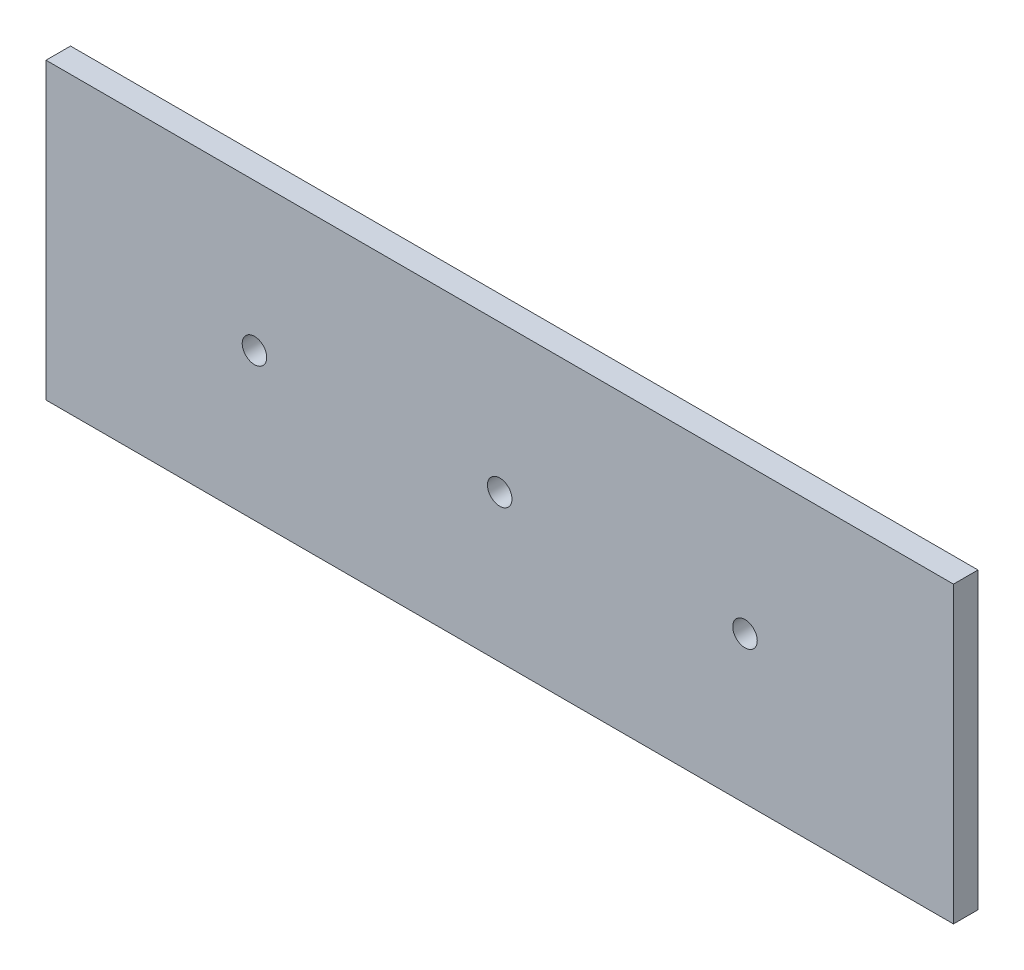
ISO-10303-21;
HEADER;
FILE_DESCRIPTION(('STEP AP214'),'2;1');
FILE_NAME('part.step','',(''),(''),'','','');
FILE_SCHEMA(('AUTOMOTIVE_DESIGN { 1 0 10303 214 1 1 1 1 }'));
ENDSEC;
DATA;
#1=APPLICATION_CONTEXT('core data for automotive mechanical design processes');
#2=APPLICATION_PROTOCOL_DEFINITION('international standard','automotive_design',2000,#1);
#3=PRODUCT_CONTEXT('',#1,'mechanical');
#4=PRODUCT('Part','Part','',(#3));
#5=PRODUCT_RELATED_PRODUCT_CATEGORY('part','',(#4));
#6=PRODUCT_DEFINITION_FORMATION('','',#4);
#7=PRODUCT_DEFINITION_CONTEXT('part definition',#1,'design');
#8=PRODUCT_DEFINITION('design','',#6,#7);
#9=PRODUCT_DEFINITION_SHAPE('','',#8);
#10=(LENGTH_UNIT() NAMED_UNIT(*) SI_UNIT(.MILLI.,.METRE.));
#11=(NAMED_UNIT(*) PLANE_ANGLE_UNIT() SI_UNIT($,.RADIAN.));
#12=(NAMED_UNIT(*) SI_UNIT($,.STERADIAN.) SOLID_ANGLE_UNIT());
#13=UNCERTAINTY_MEASURE_WITH_UNIT(LENGTH_MEASURE(1.E-05),#10,'distance_accuracy_value','');
#14=(GEOMETRIC_REPRESENTATION_CONTEXT(3) GLOBAL_UNCERTAINTY_ASSIGNED_CONTEXT((#13)) GLOBAL_UNIT_ASSIGNED_CONTEXT((#10,
#11,#12)) REPRESENTATION_CONTEXT('',''));
#15=CARTESIAN_POINT('',(0.,0.,0.));
#16=DIRECTION('',(0.,0.,1.));
#17=DIRECTION('',(1.,0.,0.));
#18=AXIS2_PLACEMENT_3D('',#15,#16,#17);
#19=CARTESIAN_POINT('',(117.475,38.1,6.35));
#20=DIRECTION('',(-1.,0.,0.));
#21=DIRECTION('',(0.,0.,1.));
#22=AXIS2_PLACEMENT_3D('',#19,#20,#21);
#23=PLANE('',#22);
#24=DIRECTION('',(0.,1.,0.));
#25=VECTOR('',#24,1.);
#26=CARTESIAN_POINT('',(117.475,38.1,0.));
#27=LINE('',#26,#25);
#28=CARTESIAN_POINT('',(117.475,-38.1,0.));
#29=VERTEX_POINT('',#28);
#30=CARTESIAN_POINT('',(117.475,38.1,0.));
#31=VERTEX_POINT('',#30);
#32=EDGE_CURVE('E97',#29,#31,#27,.T.);
#33=ORIENTED_EDGE('',*,*,#32,.T.);
#34=DIRECTION('',(0.,0.,-1.));
#35=VECTOR('',#34,1.);
#36=CARTESIAN_POINT('',(117.475,38.1,6.35));
#37=LINE('',#36,#35);
#38=CARTESIAN_POINT('',(117.475,38.1,6.35));
#39=VERTEX_POINT('',#38);
#40=EDGE_CURVE('E11',#39,#31,#37,.T.);
#41=ORIENTED_EDGE('',*,*,#40,.F.);
#42=DIRECTION('',(0.,1.,0.));
#43=VECTOR('',#42,1.);
#44=CARTESIAN_POINT('',(117.475,38.1,6.35));
#45=LINE('',#44,#43);
#46=CARTESIAN_POINT('',(117.475,-38.1,6.35));
#47=VERTEX_POINT('',#46);
#48=EDGE_CURVE('E85',#47,#39,#45,.T.);
#49=ORIENTED_EDGE('',*,*,#48,.F.);
#50=DIRECTION('',(0.,0.,-1.));
#51=VECTOR('',#50,1.);
#52=CARTESIAN_POINT('',(117.475,-38.1,6.35));
#53=LINE('',#52,#51);
#54=EDGE_CURVE('E93',#47,#29,#53,.T.);
#55=ORIENTED_EDGE('',*,*,#54,.T.);
#56=EDGE_LOOP('',(#33,#41,#49,#55));
#57=FACE_BOUND('',#56,.T.);
#58=ADVANCED_FACE('F34',(#57),#23,.F.);
#59=CARTESIAN_POINT('',(-117.475,38.1,6.35));
#60=DIRECTION('',(0.,-1.,0.));
#61=DIRECTION('',(0.,0.,-1.));
#62=AXIS2_PLACEMENT_3D('',#59,#60,#61);
#63=PLANE('',#62);
#64=DIRECTION('',(-1.,0.,0.));
#65=VECTOR('',#64,1.);
#66=CARTESIAN_POINT('',(-117.475,38.1,0.));
#67=LINE('',#66,#65);
#68=CARTESIAN_POINT('',(-117.475,38.1,0.));
#69=VERTEX_POINT('',#68);
#70=EDGE_CURVE('E89',#31,#69,#67,.T.);
#71=ORIENTED_EDGE('',*,*,#70,.T.);
#72=DIRECTION('',(0.,0.,-1.));
#73=VECTOR('',#72,1.);
#74=CARTESIAN_POINT('',(-117.475,38.1,6.35));
#75=LINE('',#74,#73);
#76=CARTESIAN_POINT('',(-117.475,38.1,6.35));
#77=VERTEX_POINT('',#76);
#78=EDGE_CURVE('E42',#77,#69,#75,.T.);
#79=ORIENTED_EDGE('',*,*,#78,.F.);
#80=DIRECTION('',(-1.,0.,0.));
#81=VECTOR('',#80,1.);
#82=CARTESIAN_POINT('',(-117.475,38.1,6.35));
#83=LINE('',#82,#81);
#84=EDGE_CURVE('E80',#39,#77,#83,.T.);
#85=ORIENTED_EDGE('',*,*,#84,.F.);
#86=ORIENTED_EDGE('',*,*,#40,.T.);
#87=EDGE_LOOP('',(#71,#79,#85,#86));
#88=FACE_BOUND('',#87,.T.);
#89=ADVANCED_FACE('F88',(#88),#63,.F.);
#90=CARTESIAN_POINT('',(-117.475,38.1,6.35));
#91=DIRECTION('',(1.,0.,0.));
#92=DIRECTION('',(0.,0.,-1.));
#93=AXIS2_PLACEMENT_3D('',#90,#91,#92);
#94=PLANE('',#93);
#95=DIRECTION('',(0.,-1.,0.));
#96=VECTOR('',#95,1.);
#97=CARTESIAN_POINT('',(-117.475,38.1,0.));
#98=LINE('',#97,#96);
#99=CARTESIAN_POINT('',(-117.475,-38.1,0.));
#100=VERTEX_POINT('',#99);
#101=EDGE_CURVE('E67',#69,#100,#98,.T.);
#102=ORIENTED_EDGE('',*,*,#101,.T.);
#103=DIRECTION('',(0.,0.,-1.));
#104=VECTOR('',#103,1.);
#105=CARTESIAN_POINT('',(-117.475,-38.1,6.35));
#106=LINE('',#105,#104);
#107=CARTESIAN_POINT('',(-117.475,-38.1,6.35));
#108=VERTEX_POINT('',#107);
#109=EDGE_CURVE('E90',#108,#100,#106,.T.);
#110=ORIENTED_EDGE('',*,*,#109,.F.);
#111=DIRECTION('',(0.,-1.,0.));
#112=VECTOR('',#111,1.);
#113=CARTESIAN_POINT('',(-117.475,38.1,6.35));
#114=LINE('',#113,#112);
#115=EDGE_CURVE('E83',#77,#108,#114,.T.);
#116=ORIENTED_EDGE('',*,*,#115,.F.);
#117=ORIENTED_EDGE('',*,*,#78,.T.);
#118=EDGE_LOOP('',(#102,#110,#116,#117));
#119=FACE_BOUND('',#118,.T.);
#120=ADVANCED_FACE('F91',(#119),#94,.F.);
#121=CARTESIAN_POINT('',(-117.475,-38.1,6.35));
#122=DIRECTION('',(0.,1.,0.));
#123=DIRECTION('',(0.,0.,1.));
#124=AXIS2_PLACEMENT_3D('',#121,#122,#123);
#125=PLANE('',#124);
#126=DIRECTION('',(1.,0.,0.));
#127=VECTOR('',#126,1.);
#128=CARTESIAN_POINT('',(-117.475,-38.1,0.));
#129=LINE('',#128,#127);
#130=EDGE_CURVE('E73',#100,#29,#129,.T.);
#131=ORIENTED_EDGE('',*,*,#130,.T.);
#132=ORIENTED_EDGE('',*,*,#54,.F.);
#133=DIRECTION('',(1.,0.,0.));
#134=VECTOR('',#133,1.);
#135=CARTESIAN_POINT('',(-117.475,-38.1,6.35));
#136=LINE('',#135,#134);
#137=EDGE_CURVE('E50',#108,#47,#136,.T.);
#138=ORIENTED_EDGE('',*,*,#137,.F.);
#139=ORIENTED_EDGE('',*,*,#109,.T.);
#140=EDGE_LOOP('',(#131,#132,#138,#139));
#141=FACE_BOUND('',#140,.T.);
#142=ADVANCED_FACE('F105',(#141),#125,.F.);
#143=CARTESIAN_POINT('',(0.,0.,6.35));
#144=DIRECTION('',(0.,0.,1.));
#145=DIRECTION('',(1.,0.,0.));
#146=AXIS2_PLACEMENT_3D('',#143,#144,#145);
#147=PLANE('',#146);
#148=CARTESIAN_POINT('',(63.5,0.,6.35));
#149=DIRECTION('',(0.,0.,1.));
#150=DIRECTION('',(1.,0.,0.));
#151=AXIS2_PLACEMENT_3D('',#148,#149,#150);
#152=CIRCLE('',#151,3.175);
#153=CARTESIAN_POINT('',(66.675,0.,6.35));
#154=VERTEX_POINT('',#153);
#155=EDGE_CURVE('E117',#154,#154,#152,.T.);
#156=ORIENTED_EDGE('',*,*,#155,.F.);
#157=EDGE_LOOP('',(#156));
#158=FACE_BOUND('',#157,.T.);
#159=CARTESIAN_POINT('',(-63.5,0.,6.35));
#160=DIRECTION('',(0.,0.,1.));
#161=DIRECTION('',(1.,0.,0.));
#162=AXIS2_PLACEMENT_3D('',#159,#160,#161);
#163=CIRCLE('',#162,3.175);
#164=CARTESIAN_POINT('',(-60.325,0.,6.35));
#165=VERTEX_POINT('',#164);
#166=EDGE_CURVE('E123',#165,#165,#163,.T.);
#167=ORIENTED_EDGE('',*,*,#166,.F.);
#168=EDGE_LOOP('',(#167));
#169=FACE_BOUND('',#168,.T.);
#170=CARTESIAN_POINT('',(0.,0.,6.35));
#171=DIRECTION('',(0.,0.,1.));
#172=DIRECTION('',(1.,0.,0.));
#173=AXIS2_PLACEMENT_3D('',#170,#171,#172);
#174=CIRCLE('',#173,3.175);
#175=CARTESIAN_POINT('',(3.17499999999999,0.,6.35));
#176=VERTEX_POINT('',#175);
#177=EDGE_CURVE('E111',#176,#176,#174,.T.);
#178=ORIENTED_EDGE('',*,*,#177,.F.);
#179=EDGE_LOOP('',(#178));
#180=FACE_BOUND('',#179,.T.);
#181=ORIENTED_EDGE('',*,*,#48,.T.);
#182=ORIENTED_EDGE('',*,*,#84,.T.);
#183=ORIENTED_EDGE('',*,*,#115,.T.);
#184=ORIENTED_EDGE('',*,*,#137,.T.);
#185=EDGE_LOOP('',(#181,#182,#183,#184));
#186=FACE_BOUND('',#185,.T.);
#187=ADVANCED_FACE('F81',(#158,#169,#180,#186),#147,.T.);
#188=CARTESIAN_POINT('',(0.,0.,0.));
#189=DIRECTION('',(0.,0.,1.));
#190=DIRECTION('',(1.,0.,0.));
#191=AXIS2_PLACEMENT_3D('',#188,#189,#190);
#192=PLANE('',#191);
#193=CARTESIAN_POINT('',(63.5,0.,0.));
#194=DIRECTION('',(0.,0.,1.));
#195=DIRECTION('',(1.,0.,0.));
#196=AXIS2_PLACEMENT_3D('',#193,#194,#195);
#197=CIRCLE('',#196,3.175);
#198=CARTESIAN_POINT('',(66.675,0.,0.));
#199=VERTEX_POINT('',#198);
#200=EDGE_CURVE('E120',#199,#199,#197,.T.);
#201=ORIENTED_EDGE('',*,*,#200,.T.);
#202=EDGE_LOOP('',(#201));
#203=FACE_BOUND('',#202,.T.);
#204=CARTESIAN_POINT('',(-63.5,0.,0.));
#205=DIRECTION('',(0.,0.,1.));
#206=DIRECTION('',(1.,0.,0.));
#207=AXIS2_PLACEMENT_3D('',#204,#205,#206);
#208=CIRCLE('',#207,3.175);
#209=CARTESIAN_POINT('',(-60.325,0.,0.));
#210=VERTEX_POINT('',#209);
#211=EDGE_CURVE('E114',#210,#210,#208,.T.);
#212=ORIENTED_EDGE('',*,*,#211,.T.);
#213=EDGE_LOOP('',(#212));
#214=FACE_BOUND('',#213,.T.);
#215=CARTESIAN_POINT('',(0.,0.,0.));
#216=DIRECTION('',(0.,0.,1.));
#217=DIRECTION('',(1.,0.,0.));
#218=AXIS2_PLACEMENT_3D('',#215,#216,#217);
#219=CIRCLE('',#218,3.175);
#220=CARTESIAN_POINT('',(3.17499999999999,0.,0.));
#221=VERTEX_POINT('',#220);
#222=EDGE_CURVE('E100',#221,#221,#219,.T.);
#223=ORIENTED_EDGE('',*,*,#222,.T.);
#224=EDGE_LOOP('',(#223));
#225=FACE_BOUND('',#224,.T.);
#226=ORIENTED_EDGE('',*,*,#32,.F.);
#227=ORIENTED_EDGE('',*,*,#130,.F.);
#228=ORIENTED_EDGE('',*,*,#101,.F.);
#229=ORIENTED_EDGE('',*,*,#70,.F.);
#230=EDGE_LOOP('',(#226,#227,#228,#229));
#231=FACE_BOUND('',#230,.T.);
#232=ADVANCED_FACE('F108',(#203,#214,#225,#231),#192,.F.);
#233=CARTESIAN_POINT('',(0.,0.,0.));
#234=DIRECTION('',(0.,0.,1.));
#235=DIRECTION('',(1.,0.,0.));
#236=AXIS2_PLACEMENT_3D('',#233,#234,#235);
#237=CYLINDRICAL_SURFACE('',#236,3.175);
#238=ORIENTED_EDGE('',*,*,#222,.F.);
#239=EDGE_LOOP('',(#238));
#240=FACE_BOUND('',#239,.T.);
#241=ORIENTED_EDGE('',*,*,#177,.T.);
#242=EDGE_LOOP('',(#241));
#243=FACE_BOUND('',#242,.T.);
#244=ADVANCED_FACE('F135',(#240,#243),#237,.F.);
#245=CARTESIAN_POINT('',(-63.5,0.,0.));
#246=DIRECTION('',(0.,0.,1.));
#247=DIRECTION('',(1.,0.,0.));
#248=AXIS2_PLACEMENT_3D('',#245,#246,#247);
#249=CYLINDRICAL_SURFACE('',#248,3.175);
#250=ORIENTED_EDGE('',*,*,#211,.F.);
#251=EDGE_LOOP('',(#250));
#252=FACE_BOUND('',#251,.T.);
#253=ORIENTED_EDGE('',*,*,#166,.T.);
#254=EDGE_LOOP('',(#253));
#255=FACE_BOUND('',#254,.T.);
#256=ADVANCED_FACE('F131',(#252,#255),#249,.F.);
#257=CARTESIAN_POINT('',(63.5,0.,0.));
#258=DIRECTION('',(0.,0.,1.));
#259=DIRECTION('',(1.,0.,0.));
#260=AXIS2_PLACEMENT_3D('',#257,#258,#259);
#261=CYLINDRICAL_SURFACE('',#260,3.175);
#262=ORIENTED_EDGE('',*,*,#200,.F.);
#263=EDGE_LOOP('',(#262));
#264=FACE_BOUND('',#263,.T.);
#265=ORIENTED_EDGE('',*,*,#155,.T.);
#266=EDGE_LOOP('',(#265));
#267=FACE_BOUND('',#266,.T.);
#268=ADVANCED_FACE('F134',(#264,#267),#261,.F.);
#269=CLOSED_SHELL('',(#58,#89,#120,#142,#187,#232,#244,#256,#268));
#270=MANIFOLD_SOLID_BREP('B2',#269);
#271=ADVANCED_BREP_SHAPE_REPRESENTATION('',(#18,#270),#14);
#272=SHAPE_DEFINITION_REPRESENTATION(#9,#271);
ENDSEC;
END-ISO-10303-21;
